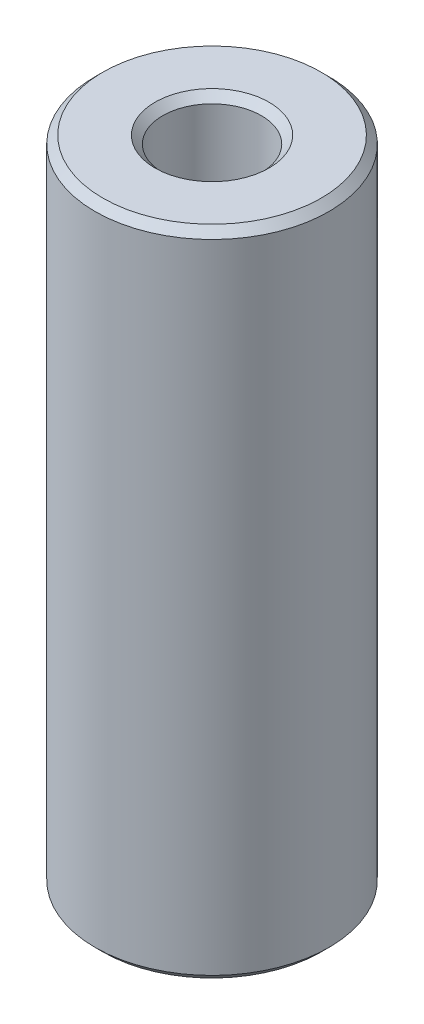
ISO-10303-21;
HEADER;
FILE_DESCRIPTION(('STEP AP214'),'2;1');
FILE_NAME('part.step','',(''),(''),'','','');
FILE_SCHEMA(('AUTOMOTIVE_DESIGN { 1 0 10303 214 1 1 1 1 }'));
ENDSEC;
DATA;
#1=APPLICATION_CONTEXT('core data for automotive mechanical design processes');
#2=APPLICATION_PROTOCOL_DEFINITION('international standard','automotive_design',2000,#1);
#3=PRODUCT_CONTEXT('',#1,'mechanical');
#4=PRODUCT('Part','Part','',(#3));
#5=PRODUCT_RELATED_PRODUCT_CATEGORY('part','',(#4));
#6=PRODUCT_DEFINITION_FORMATION('','',#4);
#7=PRODUCT_DEFINITION_CONTEXT('part definition',#1,'design');
#8=PRODUCT_DEFINITION('design','',#6,#7);
#9=PRODUCT_DEFINITION_SHAPE('','',#8);
#10=(LENGTH_UNIT() NAMED_UNIT(*) SI_UNIT(.MILLI.,.METRE.));
#11=(NAMED_UNIT(*) PLANE_ANGLE_UNIT() SI_UNIT($,.RADIAN.));
#12=(NAMED_UNIT(*) SI_UNIT($,.STERADIAN.) SOLID_ANGLE_UNIT());
#13=UNCERTAINTY_MEASURE_WITH_UNIT(LENGTH_MEASURE(1.E-05),#10,'distance_accuracy_value','');
#14=(GEOMETRIC_REPRESENTATION_CONTEXT(3) GLOBAL_UNCERTAINTY_ASSIGNED_CONTEXT((#13)) GLOBAL_UNIT_ASSIGNED_CONTEXT((#10,
#11,#12)) REPRESENTATION_CONTEXT('',''));
#15=CARTESIAN_POINT('',(0.,0.,0.));
#16=DIRECTION('',(0.,0.,1.));
#17=DIRECTION('',(1.,0.,0.));
#18=AXIS2_PLACEMENT_3D('',#15,#16,#17);
#19=CARTESIAN_POINT('',(0.,167.517779388645,0.));
#20=DIRECTION('',(0.,-1.,0.));
#21=DIRECTION('',(0.,0.,-1.));
#22=AXIS2_PLACEMENT_3D('',#19,#20,#21);
#23=CYLINDRICAL_SURFACE('',#22,30.);
#24=CARTESIAN_POINT('',(0.,1.9872340794958,0.));
#25=DIRECTION('',(0.,1.,0.));
#26=DIRECTION('',(0.,0.,1.));
#27=AXIS2_PLACEMENT_3D('',#24,#25,#26);
#28=CIRCLE('',#27,30.);
#29=CARTESIAN_POINT('',(0.,1.9872340794958,30.));
#30=VERTEX_POINT('',#29);
#31=EDGE_CURVE('E10',#30,#30,#28,.T.);
#32=ORIENTED_EDGE('',*,*,#31,.T.);
#33=EDGE_LOOP('',(#32));
#34=FACE_BOUND('',#33,.T.);
#35=CARTESIAN_POINT('',(0.,165.530545309149,0.));
#36=DIRECTION('',(0.,1.,0.));
#37=DIRECTION('',(0.,0.,1.));
#38=AXIS2_PLACEMENT_3D('',#35,#36,#37);
#39=CIRCLE('',#38,30.);
#40=CARTESIAN_POINT('',(0.,165.530545309149,30.));
#41=VERTEX_POINT('',#40);
#42=EDGE_CURVE('E50',#41,#41,#39,.F.);
#43=ORIENTED_EDGE('',*,*,#42,.T.);
#44=EDGE_LOOP('',(#43));
#45=FACE_BOUND('',#44,.T.);
#46=ADVANCED_FACE('F39',(#34,#45),#23,.T.);
#47=CARTESIAN_POINT('',(0.,167.517779388645,0.));
#48=DIRECTION('',(0.,1.,0.));
#49=DIRECTION('',(0.,0.,1.));
#50=AXIS2_PLACEMENT_3D('',#47,#48,#49);
#51=PLANE('',#50);
#52=CARTESIAN_POINT('',(0.,167.517779388645,0.));
#53=DIRECTION('',(0.,1.,0.));
#54=DIRECTION('',(0.,0.,1.));
#55=AXIS2_PLACEMENT_3D('',#52,#53,#54);
#56=CIRCLE('',#55,14.6405840830036);
#57=CARTESIAN_POINT('',(0.,167.517779388645,14.6405840830036));
#58=VERTEX_POINT('',#57);
#59=EDGE_CURVE('E58',#58,#58,#56,.F.);
#60=ORIENTED_EDGE('',*,*,#59,.T.);
#61=EDGE_LOOP('',(#60));
#62=FACE_BOUND('',#61,.T.);
#63=CARTESIAN_POINT('',(0.,167.517779388645,0.));
#64=DIRECTION('',(0.,1.,0.));
#65=DIRECTION('',(0.,0.,1.));
#66=AXIS2_PLACEMENT_3D('',#63,#64,#65);
#67=CIRCLE('',#66,28.0127659205041);
#68=CARTESIAN_POINT('',(0.,167.517779388645,28.0127659205041));
#69=VERTEX_POINT('',#68);
#70=EDGE_CURVE('E61',#69,#69,#67,.T.);
#71=ORIENTED_EDGE('',*,*,#70,.T.);
#72=EDGE_LOOP('',(#71));
#73=FACE_BOUND('',#72,.T.);
#74=ADVANCED_FACE('F88',(#62,#73),#51,.T.);
#75=CARTESIAN_POINT('',(0.,0.,0.));
#76=DIRECTION('',(0.,1.,0.));
#77=DIRECTION('',(0.,0.,1.));
#78=AXIS2_PLACEMENT_3D('',#75,#76,#77);
#79=PLANE('',#78);
#80=CARTESIAN_POINT('',(0.,0.,0.));
#81=DIRECTION('',(0.,1.,0.));
#82=DIRECTION('',(0.,0.,1.));
#83=AXIS2_PLACEMENT_3D('',#80,#81,#82);
#84=CIRCLE('',#83,14.6405840830036);
#85=CARTESIAN_POINT('',(0.,0.,14.6405840830036));
#86=VERTEX_POINT('',#85);
#87=EDGE_CURVE('E51',#86,#86,#84,.T.);
#88=ORIENTED_EDGE('',*,*,#87,.T.);
#89=EDGE_LOOP('',(#88));
#90=FACE_BOUND('',#89,.T.);
#91=CARTESIAN_POINT('',(0.,0.,0.));
#92=DIRECTION('',(0.,1.,0.));
#93=DIRECTION('',(0.,0.,1.));
#94=AXIS2_PLACEMENT_3D('',#91,#92,#93);
#95=CIRCLE('',#94,28.0127659205042);
#96=CARTESIAN_POINT('',(0.,0.,28.0127659205042));
#97=VERTEX_POINT('',#96);
#98=EDGE_CURVE('E54',#97,#97,#95,.F.);
#99=ORIENTED_EDGE('',*,*,#98,.T.);
#100=EDGE_LOOP('',(#99));
#101=FACE_BOUND('',#100,.T.);
#102=ADVANCED_FACE('F83',(#90,#101),#79,.F.);
#103=CARTESIAN_POINT('',(0.,167.517779388645,0.));
#104=DIRECTION('',(0.,-1.,0.));
#105=DIRECTION('',(0.,0.,-1.));
#106=AXIS2_PLACEMENT_3D('',#103,#104,#105);
#107=CYLINDRICAL_SURFACE('',#106,12.6533500035077);
#108=CARTESIAN_POINT('',(0.,165.530545309149,0.));
#109=DIRECTION('',(0.,1.,0.));
#110=DIRECTION('',(0.,0.,1.));
#111=AXIS2_PLACEMENT_3D('',#108,#109,#110);
#112=CIRCLE('',#111,12.6533500035077);
#113=CARTESIAN_POINT('',(0.,165.530545309149,12.6533500035077));
#114=VERTEX_POINT('',#113);
#115=EDGE_CURVE('E67',#114,#114,#112,.T.);
#116=ORIENTED_EDGE('',*,*,#115,.T.);
#117=EDGE_LOOP('',(#116));
#118=FACE_BOUND('',#117,.T.);
#119=CARTESIAN_POINT('',(0.,1.98723407949586,0.));
#120=DIRECTION('',(0.,1.,0.));
#121=DIRECTION('',(0.,0.,1.));
#122=AXIS2_PLACEMENT_3D('',#119,#120,#121);
#123=CIRCLE('',#122,12.6533500035077);
#124=CARTESIAN_POINT('',(0.,1.98723407949586,12.6533500035077));
#125=VERTEX_POINT('',#124);
#126=EDGE_CURVE('E69',#125,#125,#123,.F.);
#127=ORIENTED_EDGE('',*,*,#126,.T.);
#128=EDGE_LOOP('',(#127));
#129=FACE_BOUND('',#128,.T.);
#130=ADVANCED_FACE('F71',(#118,#129),#107,.F.);
#131=CARTESIAN_POINT('',(0.,165.530545309149,0.));
#132=DIRECTION('',(0.,1.,0.));
#133=DIRECTION('',(0.,0.,1.));
#134=AXIS2_PLACEMENT_3D('',#131,#132,#133);
#135=CONICAL_SURFACE('',#134,12.6533500035077,0.785398163397449);
#136=ORIENTED_EDGE('',*,*,#59,.F.);
#137=EDGE_LOOP('',(#136));
#138=FACE_BOUND('',#137,.T.);
#139=ORIENTED_EDGE('',*,*,#115,.F.);
#140=EDGE_LOOP('',(#139));
#141=FACE_BOUND('',#140,.T.);
#142=ADVANCED_FACE('F77',(#138,#141),#135,.F.);
#143=CARTESIAN_POINT('',(0.,0.,0.));
#144=DIRECTION('',(0.,-1.,0.));
#145=DIRECTION('',(0.,0.,-1.));
#146=AXIS2_PLACEMENT_3D('',#143,#144,#145);
#147=CONICAL_SURFACE('',#146,14.6405840830036,0.785398163397449);
#148=ORIENTED_EDGE('',*,*,#126,.F.);
#149=EDGE_LOOP('',(#148));
#150=FACE_BOUND('',#149,.T.);
#151=ORIENTED_EDGE('',*,*,#87,.F.);
#152=EDGE_LOOP('',(#151));
#153=FACE_BOUND('',#152,.T.);
#154=ADVANCED_FACE('F73',(#150,#153),#147,.F.);
#155=CARTESIAN_POINT('',(0.,1.9872340794958,0.));
#156=DIRECTION('',(0.,1.,0.));
#157=DIRECTION('',(0.,0.,1.));
#158=AXIS2_PLACEMENT_3D('',#155,#156,#157);
#159=CONICAL_SURFACE('',#158,30.,0.785398163397455);
#160=ORIENTED_EDGE('',*,*,#98,.F.);
#161=EDGE_LOOP('',(#160));
#162=FACE_BOUND('',#161,.T.);
#163=ORIENTED_EDGE('',*,*,#31,.F.);
#164=EDGE_LOOP('',(#163));
#165=FACE_BOUND('',#164,.T.);
#166=ADVANCED_FACE('F76',(#162,#165),#159,.T.);
#167=CARTESIAN_POINT('',(0.,167.517779388645,0.));
#168=DIRECTION('',(0.,-1.,0.));
#169=DIRECTION('',(0.,0.,-1.));
#170=AXIS2_PLACEMENT_3D('',#167,#168,#169);
#171=CONICAL_SURFACE('',#170,28.0127659205041,0.785398163397448);
#172=ORIENTED_EDGE('',*,*,#42,.F.);
#173=EDGE_LOOP('',(#172));
#174=FACE_BOUND('',#173,.T.);
#175=ORIENTED_EDGE('',*,*,#70,.F.);
#176=EDGE_LOOP('',(#175));
#177=FACE_BOUND('',#176,.T.);
#178=ADVANCED_FACE('F45',(#174,#177),#171,.T.);
#179=CLOSED_SHELL('',(#46,#74,#102,#130,#142,#154,#166,#178));
#180=MANIFOLD_SOLID_BREP('B2',#179);
#181=ADVANCED_BREP_SHAPE_REPRESENTATION('',(#18,#180),#14);
#182=SHAPE_DEFINITION_REPRESENTATION(#9,#181);
ENDSEC;
END-ISO-10303-21;
